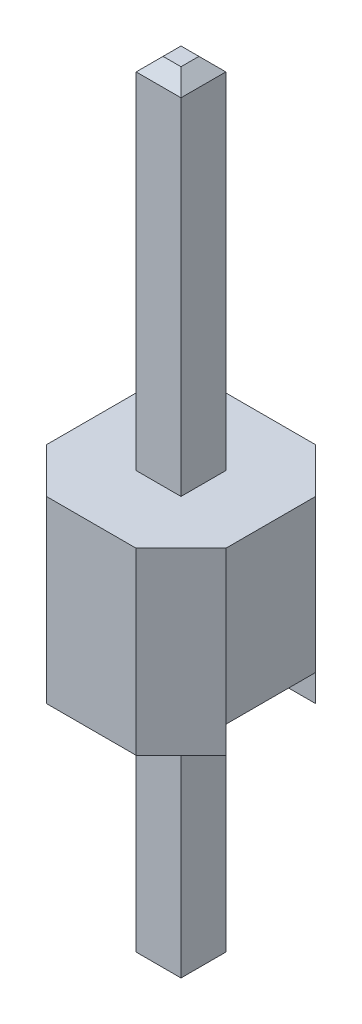
ISO-10303-21;
HEADER;
FILE_DESCRIPTION(('STEP AP214'),'2;1');
FILE_NAME('part.step','',(''),(''),'','','');
FILE_SCHEMA(('AUTOMOTIVE_DESIGN { 1 0 10303 214 1 1 1 1 }'));
ENDSEC;
DATA;
#1=APPLICATION_CONTEXT('core data for automotive mechanical design processes');
#2=APPLICATION_PROTOCOL_DEFINITION('international standard','automotive_design',2000,#1);
#3=PRODUCT_CONTEXT('',#1,'mechanical');
#4=PRODUCT('Part','Part','',(#3));
#5=PRODUCT_RELATED_PRODUCT_CATEGORY('part','',(#4));
#6=PRODUCT_DEFINITION_FORMATION('','',#4);
#7=PRODUCT_DEFINITION_CONTEXT('part definition',#1,'design');
#8=PRODUCT_DEFINITION('design','',#6,#7);
#9=PRODUCT_DEFINITION_SHAPE('','',#8);
#10=(LENGTH_UNIT() NAMED_UNIT(*) SI_UNIT(.MILLI.,.METRE.));
#11=(NAMED_UNIT(*) PLANE_ANGLE_UNIT() SI_UNIT($,.RADIAN.));
#12=(NAMED_UNIT(*) SI_UNIT($,.STERADIAN.) SOLID_ANGLE_UNIT());
#13=UNCERTAINTY_MEASURE_WITH_UNIT(LENGTH_MEASURE(1.E-05),#10,'distance_accuracy_value','');
#14=(GEOMETRIC_REPRESENTATION_CONTEXT(3) GLOBAL_UNCERTAINTY_ASSIGNED_CONTEXT((#13)) GLOBAL_UNIT_ASSIGNED_CONTEXT((#10,
#11,#12)) REPRESENTATION_CONTEXT('',''));
#15=CARTESIAN_POINT('',(0.,0.,0.));
#16=DIRECTION('',(0.,0.,1.));
#17=DIRECTION('',(1.,0.,0.));
#18=AXIS2_PLACEMENT_3D('',#15,#16,#17);
#19=CARTESIAN_POINT('',(-2.59591892663164,0.381,0.634999999999996));
#20=DIRECTION('',(0.,1.,0.));
#21=DIRECTION('',(0.,0.,1.));
#22=AXIS2_PLACEMENT_3D('',#19,#20,#21);
#23=PLANE('',#22);
#24=DIRECTION('',(0.,0.,-1.));
#25=VECTOR('',#24,1.);
#26=CARTESIAN_POINT('',(-1.27,0.381,0.635000000000008));
#27=LINE('',#26,#25);
#28=CARTESIAN_POINT('',(-1.27,0.381,0.634999999999998));
#29=VERTEX_POINT('',#28);
#30=CARTESIAN_POINT('',(-1.26999999999999,0.381,-0.635000000000004));
#31=VERTEX_POINT('',#30);
#32=EDGE_CURVE('E240',#29,#31,#27,.T.);
#33=ORIENTED_EDGE('',*,*,#32,.T.);
#34=DIRECTION('',(1.,0.,0.));
#35=VECTOR('',#34,1.);
#36=CARTESIAN_POINT('',(-2.59591892663164,0.381,-0.635000000000004));
#37=LINE('',#36,#35);
#38=CARTESIAN_POINT('',(1.27,0.381,-0.634999999999998));
#39=VERTEX_POINT('',#38);
#40=EDGE_CURVE('E248',#31,#39,#37,.T.);
#41=ORIENTED_EDGE('',*,*,#40,.T.);
#42=DIRECTION('',(0.,0.,1.));
#43=VECTOR('',#42,1.);
#44=CARTESIAN_POINT('',(1.27,0.381,0.635000000000002));
#45=LINE('',#44,#43);
#46=CARTESIAN_POINT('',(1.27,0.381,0.635000000000002));
#47=VERTEX_POINT('',#46);
#48=EDGE_CURVE('E243',#39,#47,#45,.T.);
#49=ORIENTED_EDGE('',*,*,#48,.T.);
#50=DIRECTION('',(1.,0.,0.));
#51=VECTOR('',#50,1.);
#52=CARTESIAN_POINT('',(-2.59591892663164,0.381,0.634999999999996));
#53=LINE('',#52,#51);
#54=EDGE_CURVE('E253',#29,#47,#53,.T.);
#55=ORIENTED_EDGE('',*,*,#54,.F.);
#56=EDGE_LOOP('',(#33,#41,#49,#55));
#57=FACE_BOUND('',#56,.T.);
#58=DIRECTION('',(0.,0.,1.));
#59=VECTOR('',#58,1.);
#60=CARTESIAN_POINT('',(0.3175,0.381,-0.3175));
#61=LINE('',#60,#59);
#62=CARTESIAN_POINT('',(0.3175,0.381,-0.3175));
#63=VERTEX_POINT('',#62);
#64=CARTESIAN_POINT('',(0.3175,0.381,0.3175));
#65=VERTEX_POINT('',#64);
#66=EDGE_CURVE('E185',#63,#65,#61,.T.);
#67=ORIENTED_EDGE('',*,*,#66,.F.);
#68=DIRECTION('',(1.,0.,0.));
#69=VECTOR('',#68,1.);
#70=CARTESIAN_POINT('',(-0.3175,0.381,-0.3175));
#71=LINE('',#70,#69);
#72=CARTESIAN_POINT('',(-0.3175,0.381,-0.3175));
#73=VERTEX_POINT('',#72);
#74=EDGE_CURVE('E190',#73,#63,#71,.T.);
#75=ORIENTED_EDGE('',*,*,#74,.F.);
#76=DIRECTION('',(0.,0.,-1.));
#77=VECTOR('',#76,1.);
#78=CARTESIAN_POINT('',(-0.3175,0.381,-0.3175));
#79=LINE('',#78,#77);
#80=CARTESIAN_POINT('',(-0.3175,0.381,0.3175));
#81=VERTEX_POINT('',#80);
#82=EDGE_CURVE('E202',#81,#73,#79,.T.);
#83=ORIENTED_EDGE('',*,*,#82,.F.);
#84=DIRECTION('',(-1.,0.,0.));
#85=VECTOR('',#84,1.);
#86=CARTESIAN_POINT('',(-0.3175,0.381,0.3175));
#87=LINE('',#86,#85);
#88=EDGE_CURVE('E198',#65,#81,#87,.T.);
#89=ORIENTED_EDGE('',*,*,#88,.F.);
#90=EDGE_LOOP('',(#67,#75,#83,#89));
#91=FACE_BOUND('',#90,.T.);
#92=ADVANCED_FACE('F35',(#57,#91),#23,.F.);
#93=CARTESIAN_POINT('',(0.,2.54,0.));
#94=DIRECTION('',(0.,1.,0.));
#95=DIRECTION('',(0.,0.,1.));
#96=AXIS2_PLACEMENT_3D('',#93,#94,#95);
#97=PLANE('',#96);
#98=DIRECTION('',(-1.,0.,0.));
#99=VECTOR('',#98,1.);
#100=CARTESIAN_POINT('',(-0.634999999999986,2.54,-1.27000000000001));
#101=LINE('',#100,#99);
#102=CARTESIAN_POINT('',(0.634999999999999,2.54,-1.27));
#103=VERTEX_POINT('',#102);
#104=CARTESIAN_POINT('',(-0.634999999999986,2.54,-1.27000000000001));
#105=VERTEX_POINT('',#104);
#106=EDGE_CURVE('E258',#103,#105,#101,.T.);
#107=ORIENTED_EDGE('',*,*,#106,.T.);
#108=DIRECTION('',(-0.707106781186555,0.,0.70710678118654));
#109=VECTOR('',#108,1.);
#110=CARTESIAN_POINT('',(-1.26999999999999,2.54,-0.635000000000013));
#111=LINE('',#110,#109);
#112=CARTESIAN_POINT('',(-1.26999999999999,2.54,-0.635000000000013));
#113=VERTEX_POINT('',#112);
#114=EDGE_CURVE('E261',#105,#113,#111,.T.);
#115=ORIENTED_EDGE('',*,*,#114,.T.);
#116=DIRECTION('',(0.,0.,1.));
#117=VECTOR('',#116,1.);
#118=CARTESIAN_POINT('',(-1.27,2.54,0.63499999999999));
#119=LINE('',#118,#117);
#120=CARTESIAN_POINT('',(-1.27,2.54,0.63499999999999));
#121=VERTEX_POINT('',#120);
#122=EDGE_CURVE('E264',#113,#121,#119,.T.);
#123=ORIENTED_EDGE('',*,*,#122,.T.);
#124=DIRECTION('',(0.707106781186542,0.,0.707106781186553));
#125=VECTOR('',#124,1.);
#126=CARTESIAN_POINT('',(-0.635000000000008,2.54,1.27));
#127=LINE('',#126,#125);
#128=CARTESIAN_POINT('',(-0.635000000000008,2.54,1.27));
#129=VERTEX_POINT('',#128);
#130=EDGE_CURVE('E266',#121,#129,#127,.T.);
#131=ORIENTED_EDGE('',*,*,#130,.T.);
#132=DIRECTION('',(1.,0.,0.));
#133=VECTOR('',#132,1.);
#134=CARTESIAN_POINT('',(-0.635000000000008,2.54,1.27));
#135=LINE('',#134,#133);
#136=CARTESIAN_POINT('',(0.634999999999995,2.54,1.27));
#137=VERTEX_POINT('',#136);
#138=EDGE_CURVE('E268',#129,#137,#135,.T.);
#139=ORIENTED_EDGE('',*,*,#138,.T.);
#140=DIRECTION('',(0.70710678118655,0.,-0.707106781186545));
#141=VECTOR('',#140,1.);
#142=CARTESIAN_POINT('',(1.27,2.54,0.635000000000004));
#143=LINE('',#142,#141);
#144=CARTESIAN_POINT('',(1.27,2.54,0.635000000000004));
#145=VERTEX_POINT('',#144);
#146=EDGE_CURVE('E270',#137,#145,#143,.T.);
#147=ORIENTED_EDGE('',*,*,#146,.T.);
#148=DIRECTION('',(0.,0.,-1.));
#149=VECTOR('',#148,1.);
#150=CARTESIAN_POINT('',(1.27,2.54,0.635000000000004));
#151=LINE('',#150,#149);
#152=CARTESIAN_POINT('',(1.27,2.54,-0.634999999999999));
#153=VERTEX_POINT('',#152);
#154=EDGE_CURVE('E272',#145,#153,#151,.T.);
#155=ORIENTED_EDGE('',*,*,#154,.T.);
#156=DIRECTION('',(-0.707106781186548,0.,-0.707106781186548));
#157=VECTOR('',#156,1.);
#158=CARTESIAN_POINT('',(0.634999999999999,2.54,-1.27));
#159=LINE('',#158,#157);
#160=EDGE_CURVE('E274',#153,#103,#159,.T.);
#161=ORIENTED_EDGE('',*,*,#160,.T.);
#162=EDGE_LOOP('',(#107,#115,#123,#131,#139,#147,#155,#161));
#163=FACE_BOUND('',#162,.T.);
#164=DIRECTION('',(-1.,0.,0.));
#165=VECTOR('',#164,1.);
#166=CARTESIAN_POINT('',(-0.3175,2.54,-0.3175));
#167=LINE('',#166,#165);
#168=CARTESIAN_POINT('',(0.3175,2.54,-0.3175));
#169=VERTEX_POINT('',#168);
#170=CARTESIAN_POINT('',(-0.3175,2.54,-0.3175));
#171=VERTEX_POINT('',#170);
#172=EDGE_CURVE('E216',#169,#171,#167,.T.);
#173=ORIENTED_EDGE('',*,*,#172,.F.);
#174=DIRECTION('',(0.,0.,-1.));
#175=VECTOR('',#174,1.);
#176=CARTESIAN_POINT('',(0.3175,2.54,0.3175));
#177=LINE('',#176,#175);
#178=CARTESIAN_POINT('',(0.3175,2.54,0.3175));
#179=VERTEX_POINT('',#178);
#180=EDGE_CURVE('E213',#179,#169,#177,.T.);
#181=ORIENTED_EDGE('',*,*,#180,.F.);
#182=DIRECTION('',(1.,0.,0.));
#183=VECTOR('',#182,1.);
#184=CARTESIAN_POINT('',(-0.3175,2.54,0.3175));
#185=LINE('',#184,#183);
#186=CARTESIAN_POINT('',(-0.3175,2.54,0.3175));
#187=VERTEX_POINT('',#186);
#188=EDGE_CURVE('E223',#187,#179,#185,.T.);
#189=ORIENTED_EDGE('',*,*,#188,.F.);
#190=DIRECTION('',(0.,0.,1.));
#191=VECTOR('',#190,1.);
#192=CARTESIAN_POINT('',(-0.3175,2.54,0.3175));
#193=LINE('',#192,#191);
#194=EDGE_CURVE('E220',#171,#187,#193,.T.);
#195=ORIENTED_EDGE('',*,*,#194,.F.);
#196=EDGE_LOOP('',(#173,#181,#189,#195));
#197=FACE_BOUND('',#196,.T.);
#198=ADVANCED_FACE('F388',(#163,#197),#97,.T.);
#199=CARTESIAN_POINT('',(0.,0.,0.));
#200=DIRECTION('',(0.,1.,0.));
#201=DIRECTION('',(0.,0.,1.));
#202=AXIS2_PLACEMENT_3D('',#199,#200,#201);
#203=PLANE('',#202);
#204=DIRECTION('',(-0.707106781186548,0.,-0.707106781186548));
#205=VECTOR('',#204,1.);
#206=CARTESIAN_POINT('',(0.634999999999999,0.,-1.27));
#207=LINE('',#206,#205);
#208=CARTESIAN_POINT('',(1.27,0.,-0.634999999999999));
#209=VERTEX_POINT('',#208);
#210=CARTESIAN_POINT('',(0.634999999999999,0.,-1.27));
#211=VERTEX_POINT('',#210);
#212=EDGE_CURVE('E262',#209,#211,#207,.T.);
#213=ORIENTED_EDGE('',*,*,#212,.F.);
#214=DIRECTION('',(1.,0.,0.));
#215=VECTOR('',#214,1.);
#216=CARTESIAN_POINT('',(-2.59591892663164,0.,-0.635000000000005));
#217=LINE('',#216,#215);
#218=CARTESIAN_POINT('',(-1.26999999999999,0.,-0.635000000000006));
#219=VERTEX_POINT('',#218);
#220=EDGE_CURVE('E238',#219,#209,#217,.T.);
#221=ORIENTED_EDGE('',*,*,#220,.F.);
#222=DIRECTION('',(-0.707106781186555,0.,0.70710678118654));
#223=VECTOR('',#222,1.);
#224=CARTESIAN_POINT('',(-1.26999999999999,0.,-0.635000000000013));
#225=LINE('',#224,#223);
#226=CARTESIAN_POINT('',(-0.634999999999986,0.,-1.27000000000001));
#227=VERTEX_POINT('',#226);
#228=EDGE_CURVE('E279',#227,#219,#225,.T.);
#229=ORIENTED_EDGE('',*,*,#228,.F.);
#230=DIRECTION('',(-1.,0.,0.));
#231=VECTOR('',#230,1.);
#232=CARTESIAN_POINT('',(-0.634999999999986,0.,-1.27000000000001));
#233=LINE('',#232,#231);
#234=EDGE_CURVE('E257',#211,#227,#233,.T.);
#235=ORIENTED_EDGE('',*,*,#234,.F.);
#236=EDGE_LOOP('',(#213,#221,#229,#235));
#237=FACE_BOUND('',#236,.T.);
#238=ADVANCED_FACE('F394',(#237),#203,.F.);
#239=CARTESIAN_POINT('',(-0.634999999999986,2.54,-1.27000000000001));
#240=DIRECTION('',(0.,0.,1.));
#241=DIRECTION('',(1.,0.,0.));
#242=AXIS2_PLACEMENT_3D('',#239,#240,#241);
#243=PLANE('',#242);
#244=ORIENTED_EDGE('',*,*,#234,.T.);
#245=DIRECTION('',(0.,-1.,0.));
#246=VECTOR('',#245,1.);
#247=CARTESIAN_POINT('',(-0.634999999999986,2.54,-1.27000000000001));
#248=LINE('',#247,#246);
#249=EDGE_CURVE('E310',#105,#227,#248,.T.);
#250=ORIENTED_EDGE('',*,*,#249,.F.);
#251=ORIENTED_EDGE('',*,*,#106,.F.);
#252=DIRECTION('',(0.,-1.,0.));
#253=VECTOR('',#252,1.);
#254=CARTESIAN_POINT('',(0.634999999999999,2.54,-1.27));
#255=LINE('',#254,#253);
#256=EDGE_CURVE('E276',#103,#211,#255,.T.);
#257=ORIENTED_EDGE('',*,*,#256,.T.);
#258=EDGE_LOOP('',(#244,#250,#251,#257));
#259=FACE_BOUND('',#258,.T.);
#260=ADVANCED_FACE('F436',(#259),#243,.F.);
#261=CARTESIAN_POINT('',(-1.26999999999999,2.54,-0.635000000000013));
#262=DIRECTION('',(0.70710678118654,0.,0.707106781186555));
#263=DIRECTION('',(0.707106781186555,0.,-0.70710678118654));
#264=AXIS2_PLACEMENT_3D('',#261,#262,#263);
#265=PLANE('',#264);
#266=ORIENTED_EDGE('',*,*,#228,.T.);
#267=DIRECTION('',(0.,-1.,0.));
#268=VECTOR('',#267,1.);
#269=CARTESIAN_POINT('',(-1.26999999999999,0.,-0.635000000000003));
#270=LINE('',#269,#268);
#271=EDGE_CURVE('E237',#31,#219,#270,.T.);
#272=ORIENTED_EDGE('',*,*,#271,.F.);
#273=DIRECTION('',(0.,-1.,0.));
#274=VECTOR('',#273,1.);
#275=CARTESIAN_POINT('',(-1.26999999999999,2.54,-0.635000000000013));
#276=LINE('',#275,#274);
#277=EDGE_CURVE('E307',#113,#31,#276,.T.);
#278=ORIENTED_EDGE('',*,*,#277,.F.);
#279=ORIENTED_EDGE('',*,*,#114,.F.);
#280=ORIENTED_EDGE('',*,*,#249,.T.);
#281=EDGE_LOOP('',(#266,#272,#278,#279,#280));
#282=FACE_BOUND('',#281,.T.);
#283=ADVANCED_FACE('F432',(#282),#265,.F.);
#284=CARTESIAN_POINT('',(-1.27,2.54,0.63499999999999));
#285=DIRECTION('',(1.,0.,0.));
#286=DIRECTION('',(0.,0.,-1.));
#287=AXIS2_PLACEMENT_3D('',#284,#285,#286);
#288=PLANE('',#287);
#289=ORIENTED_EDGE('',*,*,#277,.T.);
#290=ORIENTED_EDGE('',*,*,#32,.F.);
#291=DIRECTION('',(0.,-1.,0.));
#292=VECTOR('',#291,1.);
#293=CARTESIAN_POINT('',(-1.27,2.54,0.63499999999999));
#294=LINE('',#293,#292);
#295=EDGE_CURVE('E304',#121,#29,#294,.T.);
#296=ORIENTED_EDGE('',*,*,#295,.F.);
#297=ORIENTED_EDGE('',*,*,#122,.F.);
#298=EDGE_LOOP('',(#289,#290,#296,#297));
#299=FACE_BOUND('',#298,.T.);
#300=ADVANCED_FACE('F428',(#299),#288,.F.);
#301=CARTESIAN_POINT('',(-0.635000000000008,2.54,1.27));
#302=DIRECTION('',(0.707106781186553,0.,-0.707106781186542));
#303=DIRECTION('',(-0.707106781186542,0.,-0.707106781186553));
#304=AXIS2_PLACEMENT_3D('',#301,#302,#303);
#305=PLANE('',#304);
#306=DIRECTION('',(0.707106781186542,0.,0.707106781186553));
#307=VECTOR('',#306,1.);
#308=CARTESIAN_POINT('',(-0.635000000000008,0.,1.27));
#309=LINE('',#308,#307);
#310=CARTESIAN_POINT('',(-1.27,0.,0.635));
#311=VERTEX_POINT('',#310);
#312=CARTESIAN_POINT('',(-0.635000000000008,0.,1.27));
#313=VERTEX_POINT('',#312);
#314=EDGE_CURVE('E282',#311,#313,#309,.T.);
#315=ORIENTED_EDGE('',*,*,#314,.T.);
#316=DIRECTION('',(0.,-1.,0.));
#317=VECTOR('',#316,1.);
#318=CARTESIAN_POINT('',(-0.635000000000008,2.54,1.27));
#319=LINE('',#318,#317);
#320=EDGE_CURVE('E301',#129,#313,#319,.T.);
#321=ORIENTED_EDGE('',*,*,#320,.F.);
#322=ORIENTED_EDGE('',*,*,#130,.F.);
#323=ORIENTED_EDGE('',*,*,#295,.T.);
#324=DIRECTION('',(0.,1.,0.));
#325=VECTOR('',#324,1.);
#326=CARTESIAN_POINT('',(-1.27,0.,0.635));
#327=LINE('',#326,#325);
#328=EDGE_CURVE('E235',#311,#29,#327,.T.);
#329=ORIENTED_EDGE('',*,*,#328,.F.);
#330=EDGE_LOOP('',(#315,#321,#322,#323,#329));
#331=FACE_BOUND('',#330,.T.);
#332=ADVANCED_FACE('F424',(#331),#305,.F.);
#333=CARTESIAN_POINT('',(-0.635000000000008,2.54,1.27));
#334=DIRECTION('',(0.,0.,-1.));
#335=DIRECTION('',(-1.,0.,0.));
#336=AXIS2_PLACEMENT_3D('',#333,#334,#335);
#337=PLANE('',#336);
#338=DIRECTION('',(1.,0.,0.));
#339=VECTOR('',#338,1.);
#340=CARTESIAN_POINT('',(-0.635000000000008,0.,1.27));
#341=LINE('',#340,#339);
#342=CARTESIAN_POINT('',(0.634999999999995,0.,1.27));
#343=VERTEX_POINT('',#342);
#344=EDGE_CURVE('E284',#313,#343,#341,.T.);
#345=ORIENTED_EDGE('',*,*,#344,.T.);
#346=DIRECTION('',(0.,-1.,0.));
#347=VECTOR('',#346,1.);
#348=CARTESIAN_POINT('',(0.634999999999995,2.54,1.27));
#349=LINE('',#348,#347);
#350=EDGE_CURVE('E298',#137,#343,#349,.T.);
#351=ORIENTED_EDGE('',*,*,#350,.F.);
#352=ORIENTED_EDGE('',*,*,#138,.F.);
#353=ORIENTED_EDGE('',*,*,#320,.T.);
#354=EDGE_LOOP('',(#345,#351,#352,#353));
#355=FACE_BOUND('',#354,.T.);
#356=ADVANCED_FACE('F420',(#355),#337,.F.);
#357=CARTESIAN_POINT('',(1.27,2.54,0.635000000000004));
#358=DIRECTION('',(-0.707106781186545,0.,-0.70710678118655));
#359=DIRECTION('',(-0.70710678118655,0.,0.707106781186545));
#360=AXIS2_PLACEMENT_3D('',#357,#358,#359);
#361=PLANE('',#360);
#362=DIRECTION('',(0.70710678118655,0.,-0.707106781186545));
#363=VECTOR('',#362,1.);
#364=CARTESIAN_POINT('',(1.27,0.,0.635000000000004));
#365=LINE('',#364,#363);
#366=CARTESIAN_POINT('',(1.27,0.,0.635000000000004));
#367=VERTEX_POINT('',#366);
#368=EDGE_CURVE('E286',#343,#367,#365,.T.);
#369=ORIENTED_EDGE('',*,*,#368,.T.);
#370=DIRECTION('',(0.,-1.,0.));
#371=VECTOR('',#370,1.);
#372=CARTESIAN_POINT('',(1.27,0.,0.635000000000004));
#373=LINE('',#372,#371);
#374=EDGE_CURVE('E246',#47,#367,#373,.T.);
#375=ORIENTED_EDGE('',*,*,#374,.F.);
#376=DIRECTION('',(0.,-1.,0.));
#377=VECTOR('',#376,1.);
#378=CARTESIAN_POINT('',(1.27,2.54,0.635000000000004));
#379=LINE('',#378,#377);
#380=EDGE_CURVE('E295',#145,#47,#379,.T.);
#381=ORIENTED_EDGE('',*,*,#380,.F.);
#382=ORIENTED_EDGE('',*,*,#146,.F.);
#383=ORIENTED_EDGE('',*,*,#350,.T.);
#384=EDGE_LOOP('',(#369,#375,#381,#382,#383));
#385=FACE_BOUND('',#384,.T.);
#386=ADVANCED_FACE('F416',(#385),#361,.F.);
#387=CARTESIAN_POINT('',(1.27,2.54,0.635000000000004));
#388=DIRECTION('',(-1.,0.,0.));
#389=DIRECTION('',(0.,0.,1.));
#390=AXIS2_PLACEMENT_3D('',#387,#388,#389);
#391=PLANE('',#390);
#392=ORIENTED_EDGE('',*,*,#380,.T.);
#393=ORIENTED_EDGE('',*,*,#48,.F.);
#394=DIRECTION('',(0.,-1.,0.));
#395=VECTOR('',#394,1.);
#396=CARTESIAN_POINT('',(1.27,2.54,-0.634999999999999));
#397=LINE('',#396,#395);
#398=EDGE_CURVE('E292',#153,#39,#397,.T.);
#399=ORIENTED_EDGE('',*,*,#398,.F.);
#400=ORIENTED_EDGE('',*,*,#154,.F.);
#401=EDGE_LOOP('',(#392,#393,#399,#400));
#402=FACE_BOUND('',#401,.T.);
#403=ADVANCED_FACE('F412',(#402),#391,.F.);
#404=CARTESIAN_POINT('',(0.634999999999999,2.54,-1.27));
#405=DIRECTION('',(-0.707106781186548,0.,0.707106781186548));
#406=DIRECTION('',(0.707106781186548,0.,0.707106781186548));
#407=AXIS2_PLACEMENT_3D('',#404,#405,#406);
#408=PLANE('',#407);
#409=ORIENTED_EDGE('',*,*,#212,.T.);
#410=ORIENTED_EDGE('',*,*,#256,.F.);
#411=ORIENTED_EDGE('',*,*,#160,.F.);
#412=ORIENTED_EDGE('',*,*,#398,.T.);
#413=DIRECTION('',(0.,1.,0.));
#414=VECTOR('',#413,1.);
#415=CARTESIAN_POINT('',(1.27,0.,-0.634999999999999));
#416=LINE('',#415,#414);
#417=EDGE_CURVE('E234',#209,#39,#416,.T.);
#418=ORIENTED_EDGE('',*,*,#417,.F.);
#419=EDGE_LOOP('',(#409,#410,#411,#412,#418));
#420=FACE_BOUND('',#419,.T.);
#421=ADVANCED_FACE('F408',(#420),#408,.F.);
#422=ORIENTED_EDGE('',*,*,#314,.F.);
#423=DIRECTION('',(1.,0.,0.));
#424=VECTOR('',#423,1.);
#425=CARTESIAN_POINT('',(-2.59591892663164,0.,0.634999999999998));
#426=LINE('',#425,#424);
#427=EDGE_CURVE('E250',#311,#367,#426,.T.);
#428=ORIENTED_EDGE('',*,*,#427,.T.);
#429=ORIENTED_EDGE('',*,*,#368,.F.);
#430=ORIENTED_EDGE('',*,*,#344,.F.);
#431=EDGE_LOOP('',(#422,#428,#429,#430));
#432=FACE_BOUND('',#431,.T.);
#433=ADVANCED_FACE('F403',(#432),#203,.F.);
#434=CARTESIAN_POINT('',(-2.59591892663164,0.,-0.635000000000005));
#435=DIRECTION('',(0.,0.,-1.));
#436=DIRECTION('',(0.,1.,0.));
#437=AXIS2_PLACEMENT_3D('',#434,#435,#436);
#438=PLANE('',#437);
#439=ORIENTED_EDGE('',*,*,#271,.T.);
#440=ORIENTED_EDGE('',*,*,#220,.T.);
#441=ORIENTED_EDGE('',*,*,#417,.T.);
#442=ORIENTED_EDGE('',*,*,#40,.F.);
#443=EDGE_LOOP('',(#439,#440,#441,#442));
#444=FACE_BOUND('',#443,.T.);
#445=ADVANCED_FACE('F401',(#444),#438,.F.);
#446=CARTESIAN_POINT('',(-2.59591892663164,0.,0.634999999999998));
#447=DIRECTION('',(0.,0.,1.));
#448=DIRECTION('',(0.,-1.,0.));
#449=AXIS2_PLACEMENT_3D('',#446,#447,#448);
#450=PLANE('',#449);
#451=ORIENTED_EDGE('',*,*,#328,.T.);
#452=ORIENTED_EDGE('',*,*,#54,.T.);
#453=ORIENTED_EDGE('',*,*,#374,.T.);
#454=ORIENTED_EDGE('',*,*,#427,.F.);
#455=EDGE_LOOP('',(#451,#452,#453,#454));
#456=FACE_BOUND('',#455,.T.);
#457=ADVANCED_FACE('F399',(#456),#450,.F.);
#458=CARTESIAN_POINT('',(0.3175,7.62,0.3175));
#459=DIRECTION('',(-1.,0.,0.));
#460=DIRECTION('',(0.,0.,1.));
#461=AXIS2_PLACEMENT_3D('',#458,#459,#460);
#462=PLANE('',#461);
#463=DIRECTION('',(0.,-1.,0.));
#464=VECTOR('',#463,1.);
#465=CARTESIAN_POINT('',(0.3175,7.62,-0.3175));
#466=LINE('',#465,#464);
#467=CARTESIAN_POINT('',(0.3175,7.4295,-0.3175));
#468=VERTEX_POINT('',#467);
#469=EDGE_CURVE('E232',#468,#169,#466,.T.);
#470=ORIENTED_EDGE('',*,*,#469,.F.);
#471=DIRECTION('',(0.,0.,1.));
#472=VECTOR('',#471,1.);
#473=CARTESIAN_POINT('',(0.3175,7.4295,0.3175));
#474=LINE('',#473,#472);
#475=CARTESIAN_POINT('',(0.3175,7.4295,0.3175));
#476=VERTEX_POINT('',#475);
#477=EDGE_CURVE('E325',#468,#476,#474,.T.);
#478=ORIENTED_EDGE('',*,*,#477,.T.);
#479=DIRECTION('',(0.,-1.,0.));
#480=VECTOR('',#479,1.);
#481=CARTESIAN_POINT('',(0.3175,7.62,0.3175));
#482=LINE('',#481,#480);
#483=EDGE_CURVE('E226',#476,#179,#482,.T.);
#484=ORIENTED_EDGE('',*,*,#483,.T.);
#485=ORIENTED_EDGE('',*,*,#180,.T.);
#486=EDGE_LOOP('',(#470,#478,#484,#485));
#487=FACE_BOUND('',#486,.T.);
#488=ADVANCED_FACE('F525',(#487),#462,.F.);
#489=CARTESIAN_POINT('',(-0.3175,7.62,-0.3175));
#490=DIRECTION('',(0.,0.,1.));
#491=DIRECTION('',(1.,0.,0.));
#492=AXIS2_PLACEMENT_3D('',#489,#490,#491);
#493=PLANE('',#492);
#494=DIRECTION('',(0.,-1.,0.));
#495=VECTOR('',#494,1.);
#496=CARTESIAN_POINT('',(-0.3175,7.62,-0.3175));
#497=LINE('',#496,#495);
#498=CARTESIAN_POINT('',(-0.3175,7.4295,-0.3175));
#499=VERTEX_POINT('',#498);
#500=EDGE_CURVE('E230',#499,#171,#497,.T.);
#501=ORIENTED_EDGE('',*,*,#500,.F.);
#502=DIRECTION('',(1.,0.,0.));
#503=VECTOR('',#502,1.);
#504=CARTESIAN_POINT('',(-0.3175,7.4295,-0.3175));
#505=LINE('',#504,#503);
#506=EDGE_CURVE('E322',#499,#468,#505,.T.);
#507=ORIENTED_EDGE('',*,*,#506,.T.);
#508=ORIENTED_EDGE('',*,*,#469,.T.);
#509=ORIENTED_EDGE('',*,*,#172,.T.);
#510=EDGE_LOOP('',(#501,#507,#508,#509));
#511=FACE_BOUND('',#510,.T.);
#512=ADVANCED_FACE('F513',(#511),#493,.F.);
#513=CARTESIAN_POINT('',(-0.3175,7.62,0.3175));
#514=DIRECTION('',(1.,0.,0.));
#515=DIRECTION('',(0.,0.,-1.));
#516=AXIS2_PLACEMENT_3D('',#513,#514,#515);
#517=PLANE('',#516);
#518=DIRECTION('',(0.,-1.,0.));
#519=VECTOR('',#518,1.);
#520=CARTESIAN_POINT('',(-0.3175,7.62,0.3175));
#521=LINE('',#520,#519);
#522=CARTESIAN_POINT('',(-0.3175,7.4295,0.3175));
#523=VERTEX_POINT('',#522);
#524=EDGE_CURVE('E228',#523,#187,#521,.T.);
#525=ORIENTED_EDGE('',*,*,#524,.F.);
#526=DIRECTION('',(0.,0.,-1.));
#527=VECTOR('',#526,1.);
#528=CARTESIAN_POINT('',(-0.3175,7.4295,0.3175));
#529=LINE('',#528,#527);
#530=EDGE_CURVE('E327',#523,#499,#529,.T.);
#531=ORIENTED_EDGE('',*,*,#530,.T.);
#532=ORIENTED_EDGE('',*,*,#500,.T.);
#533=ORIENTED_EDGE('',*,*,#194,.T.);
#534=EDGE_LOOP('',(#525,#531,#532,#533));
#535=FACE_BOUND('',#534,.T.);
#536=ADVANCED_FACE('F507',(#535),#517,.F.);
#537=CARTESIAN_POINT('',(-0.3175,7.62,0.3175));
#538=DIRECTION('',(0.,0.,-1.));
#539=DIRECTION('',(-1.,0.,0.));
#540=AXIS2_PLACEMENT_3D('',#537,#538,#539);
#541=PLANE('',#540);
#542=ORIENTED_EDGE('',*,*,#483,.F.);
#543=DIRECTION('',(-1.,0.,0.));
#544=VECTOR('',#543,1.);
#545=CARTESIAN_POINT('',(-0.3175,7.4295,0.3175));
#546=LINE('',#545,#544);
#547=EDGE_CURVE('E329',#476,#523,#546,.T.);
#548=ORIENTED_EDGE('',*,*,#547,.T.);
#549=ORIENTED_EDGE('',*,*,#524,.T.);
#550=ORIENTED_EDGE('',*,*,#188,.T.);
#551=EDGE_LOOP('',(#542,#548,#549,#550));
#552=FACE_BOUND('',#551,.T.);
#553=ADVANCED_FACE('F512',(#552),#541,.F.);
#554=CARTESIAN_POINT('',(0.,7.62,0.));
#555=DIRECTION('',(0.,-1.,0.));
#556=DIRECTION('',(0.,0.,-1.));
#557=AXIS2_PLACEMENT_3D('',#554,#555,#556);
#558=PLANE('',#557);
#559=DIRECTION('',(0.,0.,-1.));
#560=VECTOR('',#559,1.);
#561=CARTESIAN_POINT('',(0.127000000000001,7.62,0.));
#562=LINE('',#561,#560);
#563=CARTESIAN_POINT('',(0.127000000000001,7.62,0.127000000000001));
#564=VERTEX_POINT('',#563);
#565=CARTESIAN_POINT('',(0.127000000000001,7.62,-0.127000000000001));
#566=VERTEX_POINT('',#565);
#567=EDGE_CURVE('E317',#564,#566,#562,.T.);
#568=ORIENTED_EDGE('',*,*,#567,.T.);
#569=DIRECTION('',(-1.,0.,0.));
#570=VECTOR('',#569,1.);
#571=CARTESIAN_POINT('',(0.,7.62,-0.127000000000001));
#572=LINE('',#571,#570);
#573=CARTESIAN_POINT('',(-0.127000000000001,7.62,-0.127000000000001));
#574=VERTEX_POINT('',#573);
#575=EDGE_CURVE('E319',#566,#574,#572,.T.);
#576=ORIENTED_EDGE('',*,*,#575,.T.);
#577=DIRECTION('',(0.,0.,1.));
#578=VECTOR('',#577,1.);
#579=CARTESIAN_POINT('',(-0.127000000000001,7.62,0.));
#580=LINE('',#579,#578);
#581=CARTESIAN_POINT('',(-0.127000000000001,7.62,0.127000000000001));
#582=VERTEX_POINT('',#581);
#583=EDGE_CURVE('E315',#574,#582,#580,.T.);
#584=ORIENTED_EDGE('',*,*,#583,.T.);
#585=DIRECTION('',(1.,0.,0.));
#586=VECTOR('',#585,1.);
#587=CARTESIAN_POINT('',(0.,7.62,0.127000000000001));
#588=LINE('',#587,#586);
#589=EDGE_CURVE('E313',#582,#564,#588,.T.);
#590=ORIENTED_EDGE('',*,*,#589,.T.);
#591=EDGE_LOOP('',(#568,#576,#584,#590));
#592=FACE_BOUND('',#591,.T.);
#593=ADVANCED_FACE('F456',(#592),#558,.F.);
#594=CARTESIAN_POINT('',(0.,7.62,0.127000000000001));
#595=DIRECTION('',(0.,-0.707106781186546,-0.707106781186549));
#596=DIRECTION('',(1.,0.,0.));
#597=AXIS2_PLACEMENT_3D('',#594,#595,#596);
#598=PLANE('',#597);
#599=DIRECTION('',(-0.577350269189625,-0.577350269189628,0.577350269189625));
#600=VECTOR('',#599,1.);
#601=CARTESIAN_POINT('',(-0.0846666666666676,7.66233333333333,0.0846666666666676));
#602=LINE('',#601,#600);
#603=EDGE_CURVE('E335',#523,#582,#602,.F.);
#604=ORIENTED_EDGE('',*,*,#603,.F.);
#605=ORIENTED_EDGE('',*,*,#547,.F.);
#606=DIRECTION('',(-0.577350269189625,0.577350269189628,-0.577350269189625));
#607=VECTOR('',#606,1.);
#608=CARTESIAN_POINT('',(0.0846666666666676,7.66233333333333,0.0846666666666676));
#609=LINE('',#608,#607);
#610=EDGE_CURVE('E217',#564,#476,#609,.F.);
#611=ORIENTED_EDGE('',*,*,#610,.F.);
#612=ORIENTED_EDGE('',*,*,#589,.F.);
#613=EDGE_LOOP('',(#604,#605,#611,#612));
#614=FACE_BOUND('',#613,.T.);
#615=ADVANCED_FACE('F452',(#614),#598,.F.);
#616=CARTESIAN_POINT('',(0.127000000000001,7.62,0.));
#617=DIRECTION('',(-0.707106781186549,-0.707106781186546,0.));
#618=DIRECTION('',(0.,0.,-1.));
#619=AXIS2_PLACEMENT_3D('',#616,#617,#618);
#620=PLANE('',#619);
#621=ORIENTED_EDGE('',*,*,#610,.T.);
#622=ORIENTED_EDGE('',*,*,#477,.F.);
#623=DIRECTION('',(-0.577350269189625,0.577350269189628,0.577350269189625));
#624=VECTOR('',#623,1.);
#625=CARTESIAN_POINT('',(0.0846666666666676,7.66233333333333,-0.0846666666666676));
#626=LINE('',#625,#624);
#627=EDGE_CURVE('E333',#566,#468,#626,.F.);
#628=ORIENTED_EDGE('',*,*,#627,.F.);
#629=ORIENTED_EDGE('',*,*,#567,.F.);
#630=EDGE_LOOP('',(#621,#622,#628,#629));
#631=FACE_BOUND('',#630,.T.);
#632=ADVANCED_FACE('F448',(#631),#620,.F.);
#633=CARTESIAN_POINT('',(-0.127000000000001,7.62,0.));
#634=DIRECTION('',(0.707106781186549,-0.707106781186546,0.));
#635=DIRECTION('',(0.,0.,1.));
#636=AXIS2_PLACEMENT_3D('',#633,#634,#635);
#637=PLANE('',#636);
#638=ORIENTED_EDGE('',*,*,#603,.T.);
#639=ORIENTED_EDGE('',*,*,#583,.F.);
#640=DIRECTION('',(-0.577350269189625,-0.577350269189628,-0.577350269189625));
#641=VECTOR('',#640,1.);
#642=CARTESIAN_POINT('',(-0.0846666666666676,7.66233333333333,-0.0846666666666676));
#643=LINE('',#642,#641);
#644=EDGE_CURVE('E212',#499,#574,#643,.F.);
#645=ORIENTED_EDGE('',*,*,#644,.F.);
#646=ORIENTED_EDGE('',*,*,#530,.F.);
#647=EDGE_LOOP('',(#638,#639,#645,#646));
#648=FACE_BOUND('',#647,.T.);
#649=ADVANCED_FACE('F444',(#648),#637,.F.);
#650=CARTESIAN_POINT('',(0.,7.62,-0.127000000000001));
#651=DIRECTION('',(0.,-0.707106781186546,0.707106781186549));
#652=DIRECTION('',(-1.,0.,0.));
#653=AXIS2_PLACEMENT_3D('',#650,#651,#652);
#654=PLANE('',#653);
#655=ORIENTED_EDGE('',*,*,#627,.T.);
#656=ORIENTED_EDGE('',*,*,#506,.F.);
#657=ORIENTED_EDGE('',*,*,#644,.T.);
#658=ORIENTED_EDGE('',*,*,#575,.F.);
#659=EDGE_LOOP('',(#655,#656,#657,#658));
#660=FACE_BOUND('',#659,.T.);
#661=ADVANCED_FACE('F441',(#660),#654,.F.);
#662=CARTESIAN_POINT('',(0.3175,-3.556,-0.3175));
#663=DIRECTION('',(-1.,0.,0.));
#664=DIRECTION('',(0.,0.,1.));
#665=AXIS2_PLACEMENT_3D('',#662,#663,#664);
#666=PLANE('',#665);
#667=DIRECTION('',(0.,1.,0.));
#668=VECTOR('',#667,1.);
#669=CARTESIAN_POINT('',(0.3175,-3.556,0.3175));
#670=LINE('',#669,#668);
#671=CARTESIAN_POINT('',(0.3175,-3.3655,0.3175));
#672=VERTEX_POINT('',#671);
#673=EDGE_CURVE('E210',#672,#65,#670,.T.);
#674=ORIENTED_EDGE('',*,*,#673,.F.);
#675=DIRECTION('',(0.,0.,-1.));
#676=VECTOR('',#675,1.);
#677=CARTESIAN_POINT('',(0.3175,-3.3655,-0.3175));
#678=LINE('',#677,#676);
#679=CARTESIAN_POINT('',(0.3175,-3.3655,-0.3175));
#680=VERTEX_POINT('',#679);
#681=EDGE_CURVE('E44',#672,#680,#678,.T.);
#682=ORIENTED_EDGE('',*,*,#681,.T.);
#683=DIRECTION('',(0.,1.,0.));
#684=VECTOR('',#683,1.);
#685=CARTESIAN_POINT('',(0.3175,-3.556,-0.3175));
#686=LINE('',#685,#684);
#687=EDGE_CURVE('E182',#680,#63,#686,.T.);
#688=ORIENTED_EDGE('',*,*,#687,.T.);
#689=ORIENTED_EDGE('',*,*,#66,.T.);
#690=EDGE_LOOP('',(#674,#682,#688,#689));
#691=FACE_BOUND('',#690,.T.);
#692=ADVANCED_FACE('F184',(#691),#666,.F.);
#693=CARTESIAN_POINT('',(-0.3175,-3.556,0.3175));
#694=DIRECTION('',(0.,0.,-1.));
#695=DIRECTION('',(-1.,0.,0.));
#696=AXIS2_PLACEMENT_3D('',#693,#694,#695);
#697=PLANE('',#696);
#698=DIRECTION('',(0.,1.,0.));
#699=VECTOR('',#698,1.);
#700=CARTESIAN_POINT('',(-0.3175,-3.556,0.3175));
#701=LINE('',#700,#699);
#702=CARTESIAN_POINT('',(-0.3175,-3.3655,0.3175));
#703=VERTEX_POINT('',#702);
#704=EDGE_CURVE('E208',#703,#81,#701,.T.);
#705=ORIENTED_EDGE('',*,*,#704,.F.);
#706=DIRECTION('',(1.,0.,0.));
#707=VECTOR('',#706,1.);
#708=CARTESIAN_POINT('',(-0.3175,-3.3655,0.3175));
#709=LINE('',#708,#707);
#710=EDGE_CURVE('E11',#703,#672,#709,.T.);
#711=ORIENTED_EDGE('',*,*,#710,.T.);
#712=ORIENTED_EDGE('',*,*,#673,.T.);
#713=ORIENTED_EDGE('',*,*,#88,.T.);
#714=EDGE_LOOP('',(#705,#711,#712,#713));
#715=FACE_BOUND('',#714,.T.);
#716=ADVANCED_FACE('F484',(#715),#697,.F.);
#717=CARTESIAN_POINT('',(-0.3175,-3.556,-0.3175));
#718=DIRECTION('',(1.,0.,0.));
#719=DIRECTION('',(0.,0.,-1.));
#720=AXIS2_PLACEMENT_3D('',#717,#718,#719);
#721=PLANE('',#720);
#722=DIRECTION('',(0.,1.,0.));
#723=VECTOR('',#722,1.);
#724=CARTESIAN_POINT('',(-0.3175,-3.556,-0.3175));
#725=LINE('',#724,#723);
#726=CARTESIAN_POINT('',(-0.3175,-3.3655,-0.3175));
#727=VERTEX_POINT('',#726);
#728=EDGE_CURVE('E189',#727,#73,#725,.T.);
#729=ORIENTED_EDGE('',*,*,#728,.F.);
#730=DIRECTION('',(0.,0.,1.));
#731=VECTOR('',#730,1.);
#732=CARTESIAN_POINT('',(-0.3175,-3.3655,-0.3175));
#733=LINE('',#732,#731);
#734=EDGE_CURVE('E348',#727,#703,#733,.T.);
#735=ORIENTED_EDGE('',*,*,#734,.T.);
#736=ORIENTED_EDGE('',*,*,#704,.T.);
#737=ORIENTED_EDGE('',*,*,#82,.T.);
#738=EDGE_LOOP('',(#729,#735,#736,#737));
#739=FACE_BOUND('',#738,.T.);
#740=ADVANCED_FACE('F374',(#739),#721,.F.);
#741=CARTESIAN_POINT('',(-0.3175,-3.556,-0.3175));
#742=DIRECTION('',(0.,0.,1.));
#743=DIRECTION('',(1.,0.,0.));
#744=AXIS2_PLACEMENT_3D('',#741,#742,#743);
#745=PLANE('',#744);
#746=ORIENTED_EDGE('',*,*,#687,.F.);
#747=DIRECTION('',(-1.,0.,0.));
#748=VECTOR('',#747,1.);
#749=CARTESIAN_POINT('',(-0.3175,-3.3655,-0.3175));
#750=LINE('',#749,#748);
#751=EDGE_CURVE('E351',#680,#727,#750,.T.);
#752=ORIENTED_EDGE('',*,*,#751,.T.);
#753=ORIENTED_EDGE('',*,*,#728,.T.);
#754=ORIENTED_EDGE('',*,*,#74,.T.);
#755=EDGE_LOOP('',(#746,#752,#753,#754));
#756=FACE_BOUND('',#755,.T.);
#757=ADVANCED_FACE('F200',(#756),#745,.F.);
#758=CARTESIAN_POINT('',(0.,-3.556,0.));
#759=DIRECTION('',(0.,1.,0.));
#760=DIRECTION('',(0.,0.,1.));
#761=AXIS2_PLACEMENT_3D('',#758,#759,#760);
#762=PLANE('',#761);
#763=DIRECTION('',(-1.,0.,0.));
#764=VECTOR('',#763,1.);
#765=CARTESIAN_POINT('',(0.,-3.556,0.127000000000002));
#766=LINE('',#765,#764);
#767=CARTESIAN_POINT('',(0.127000000000002,-3.556,0.127000000000002));
#768=VERTEX_POINT('',#767);
#769=CARTESIAN_POINT('',(-0.127000000000002,-3.556,0.127000000000002));
#770=VERTEX_POINT('',#769);
#771=EDGE_CURVE('E331',#768,#770,#766,.T.);
#772=ORIENTED_EDGE('',*,*,#771,.T.);
#773=DIRECTION('',(0.,0.,-1.));
#774=VECTOR('',#773,1.);
#775=CARTESIAN_POINT('',(-0.127000000000002,-3.556,0.));
#776=LINE('',#775,#774);
#777=CARTESIAN_POINT('',(-0.127000000000002,-3.556,-0.127000000000002));
#778=VERTEX_POINT('',#777);
#779=EDGE_CURVE('E345',#770,#778,#776,.T.);
#780=ORIENTED_EDGE('',*,*,#779,.T.);
#781=DIRECTION('',(1.,0.,0.));
#782=VECTOR('',#781,1.);
#783=CARTESIAN_POINT('',(0.,-3.556,-0.127000000000002));
#784=LINE('',#783,#782);
#785=CARTESIAN_POINT('',(0.127000000000002,-3.556,-0.127000000000002));
#786=VERTEX_POINT('',#785);
#787=EDGE_CURVE('E343',#778,#786,#784,.T.);
#788=ORIENTED_EDGE('',*,*,#787,.T.);
#789=DIRECTION('',(0.,0.,1.));
#790=VECTOR('',#789,1.);
#791=CARTESIAN_POINT('',(0.127000000000002,-3.556,0.));
#792=LINE('',#791,#790);
#793=EDGE_CURVE('E341',#786,#768,#792,.T.);
#794=ORIENTED_EDGE('',*,*,#793,.T.);
#795=EDGE_LOOP('',(#772,#780,#788,#794));
#796=FACE_BOUND('',#795,.T.);
#797=ADVANCED_FACE('F379',(#796),#762,.F.);
#798=CARTESIAN_POINT('',(0.127000000000002,-3.556,0.));
#799=DIRECTION('',(-0.707106781186547,0.707106781186547,0.));
#800=DIRECTION('',(0.,0.,1.));
#801=AXIS2_PLACEMENT_3D('',#798,#799,#800);
#802=PLANE('',#801);
#803=DIRECTION('',(0.577350269189626,0.577350269189626,-0.577350269189626));
#804=VECTOR('',#803,1.);
#805=CARTESIAN_POINT('',(0.0846666666666681,-3.59833333333333,-0.084666666666668));
#806=LINE('',#805,#804);
#807=EDGE_CURVE('E357',#680,#786,#806,.F.);
#808=ORIENTED_EDGE('',*,*,#807,.F.);
#809=ORIENTED_EDGE('',*,*,#681,.F.);
#810=DIRECTION('',(0.577350269189626,0.577350269189626,0.577350269189626));
#811=VECTOR('',#810,1.);
#812=CARTESIAN_POINT('',(0.084666666666668,-3.59833333333333,0.0846666666666681));
#813=LINE('',#812,#811);
#814=EDGE_CURVE('E39',#768,#672,#813,.T.);
#815=ORIENTED_EDGE('',*,*,#814,.F.);
#816=ORIENTED_EDGE('',*,*,#793,.F.);
#817=EDGE_LOOP('',(#808,#809,#815,#816));
#818=FACE_BOUND('',#817,.T.);
#819=ADVANCED_FACE('F37',(#818),#802,.F.);
#820=CARTESIAN_POINT('',(0.,-3.556,0.127000000000002));
#821=DIRECTION('',(0.,0.707106781186547,-0.707106781186547));
#822=DIRECTION('',(-1.,0.,0.));
#823=AXIS2_PLACEMENT_3D('',#820,#821,#822);
#824=PLANE('',#823);
#825=ORIENTED_EDGE('',*,*,#814,.T.);
#826=ORIENTED_EDGE('',*,*,#710,.F.);
#827=DIRECTION('',(0.577350269189626,-0.577350269189626,-0.577350269189626));
#828=VECTOR('',#827,1.);
#829=CARTESIAN_POINT('',(-0.084666666666668,-3.59833333333333,0.0846666666666681));
#830=LINE('',#829,#828);
#831=EDGE_CURVE('E356',#770,#703,#830,.F.);
#832=ORIENTED_EDGE('',*,*,#831,.F.);
#833=ORIENTED_EDGE('',*,*,#771,.F.);
#834=EDGE_LOOP('',(#825,#826,#832,#833));
#835=FACE_BOUND('',#834,.T.);
#836=ADVANCED_FACE('F366',(#835),#824,.F.);
#837=CARTESIAN_POINT('',(0.,-3.556,-0.127000000000002));
#838=DIRECTION('',(0.,0.707106781186547,0.707106781186547));
#839=DIRECTION('',(1.,0.,0.));
#840=AXIS2_PLACEMENT_3D('',#837,#838,#839);
#841=PLANE('',#840);
#842=ORIENTED_EDGE('',*,*,#807,.T.);
#843=ORIENTED_EDGE('',*,*,#787,.F.);
#844=DIRECTION('',(-0.577350269189626,0.577350269189626,-0.577350269189626));
#845=VECTOR('',#844,1.);
#846=CARTESIAN_POINT('',(-0.084666666666668,-3.59833333333333,-0.084666666666668));
#847=LINE('',#846,#845);
#848=EDGE_CURVE('E354',#727,#778,#847,.F.);
#849=ORIENTED_EDGE('',*,*,#848,.F.);
#850=ORIENTED_EDGE('',*,*,#751,.F.);
#851=EDGE_LOOP('',(#842,#843,#849,#850));
#852=FACE_BOUND('',#851,.T.);
#853=ADVANCED_FACE('F371',(#852),#841,.F.);
#854=CARTESIAN_POINT('',(-0.127000000000002,-3.556,0.));
#855=DIRECTION('',(0.707106781186547,0.707106781186547,0.));
#856=DIRECTION('',(0.,0.,-1.));
#857=AXIS2_PLACEMENT_3D('',#854,#855,#856);
#858=PLANE('',#857);
#859=ORIENTED_EDGE('',*,*,#831,.T.);
#860=ORIENTED_EDGE('',*,*,#734,.F.);
#861=ORIENTED_EDGE('',*,*,#848,.T.);
#862=ORIENTED_EDGE('',*,*,#779,.F.);
#863=EDGE_LOOP('',(#859,#860,#861,#862));
#864=FACE_BOUND('',#863,.T.);
#865=ADVANCED_FACE('F376',(#864),#858,.F.);
#866=CLOSED_SHELL('',(#92,#198,#238,#260,#283,#300,#332,#356,#386,#403,#421,#433,#445,#457,#488,
#512,#536,#553,#593,#615,#632,#649,#661,#692,#716,#740,#757,#797,#819,#836,#853,#865));
#867=MANIFOLD_SOLID_BREP('B2',#866);
#868=ADVANCED_BREP_SHAPE_REPRESENTATION('',(#18,#867),#14);
#869=SHAPE_DEFINITION_REPRESENTATION(#9,#868);
ENDSEC;
END-ISO-10303-21;
